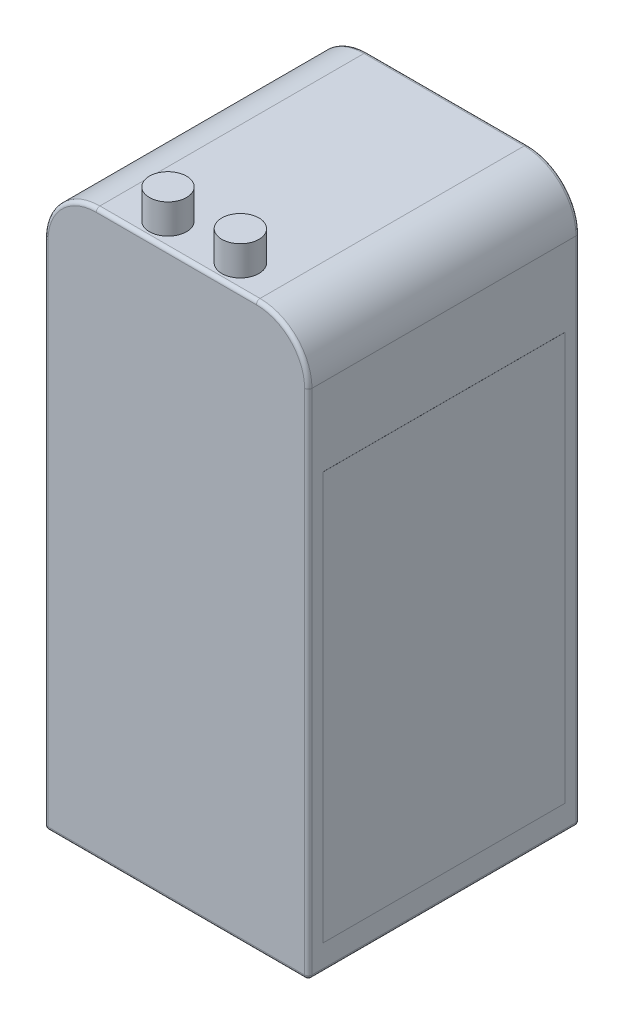
ISO-10303-21;
HEADER;
FILE_DESCRIPTION(('STEP AP214'),'2;1');
FILE_NAME('part.step','',(''),(''),'','','');
FILE_SCHEMA(('AUTOMOTIVE_DESIGN { 1 0 10303 214 1 1 1 1 }'));
ENDSEC;
DATA;
#1=APPLICATION_CONTEXT('core data for automotive mechanical design processes');
#2=APPLICATION_PROTOCOL_DEFINITION('international standard','automotive_design',2000,#1);
#3=PRODUCT_CONTEXT('',#1,'mechanical');
#4=PRODUCT('Part','Part','',(#3));
#5=PRODUCT_RELATED_PRODUCT_CATEGORY('part','',(#4));
#6=PRODUCT_DEFINITION_FORMATION('','',#4);
#7=PRODUCT_DEFINITION_CONTEXT('part definition',#1,'design');
#8=PRODUCT_DEFINITION('design','',#6,#7);
#9=PRODUCT_DEFINITION_SHAPE('','',#8);
#10=(LENGTH_UNIT() NAMED_UNIT(*) SI_UNIT(.MILLI.,.METRE.));
#11=(NAMED_UNIT(*) PLANE_ANGLE_UNIT() SI_UNIT($,.RADIAN.));
#12=(NAMED_UNIT(*) SI_UNIT($,.STERADIAN.) SOLID_ANGLE_UNIT());
#13=UNCERTAINTY_MEASURE_WITH_UNIT(LENGTH_MEASURE(1.E-05),#10,'distance_accuracy_value','');
#14=(GEOMETRIC_REPRESENTATION_CONTEXT(3) GLOBAL_UNCERTAINTY_ASSIGNED_CONTEXT((#13)) GLOBAL_UNIT_ASSIGNED_CONTEXT((#10,
#11,#12)) REPRESENTATION_CONTEXT('',''));
#15=CARTESIAN_POINT('',(0.,0.,0.));
#16=DIRECTION('',(0.,0.,1.));
#17=DIRECTION('',(1.,0.,0.));
#18=AXIS2_PLACEMENT_3D('',#15,#16,#17);
#19=CARTESIAN_POINT('',(23.120727578248,80.,-3.32332969493352));
#20=DIRECTION('',(0.,-1.,0.));
#21=DIRECTION('',(0.,0.,-1.));
#22=AXIS2_PLACEMENT_3D('',#19,#20,#21);
#23=CYLINDRICAL_SURFACE('',#22,2.5);
#24=CARTESIAN_POINT('',(23.120727578248,80.,-3.32332969493352));
#25=DIRECTION('',(0.,1.,0.));
#26=DIRECTION('',(0.,0.,1.));
#27=AXIS2_PLACEMENT_3D('',#24,#25,#26);
#28=CIRCLE('',#27,2.5);
#29=CARTESIAN_POINT('',(23.120727578248,80.,-0.823329694933518));
#30=VERTEX_POINT('',#29);
#31=EDGE_CURVE('E62',#30,#30,#28,.T.);
#32=ORIENTED_EDGE('',*,*,#31,.F.);
#33=EDGE_LOOP('',(#32));
#34=FACE_BOUND('',#33,.T.);
#35=CARTESIAN_POINT('',(23.120727578248,76.,-3.32332969493352));
#36=DIRECTION('',(0.,1.,0.));
#37=DIRECTION('',(0.,0.,1.));
#38=AXIS2_PLACEMENT_3D('',#35,#36,#37);
#39=CIRCLE('',#38,2.5);
#40=CARTESIAN_POINT('',(23.120727578248,76.,-0.823329694933518));
#41=VERTEX_POINT('',#40);
#42=EDGE_CURVE('E11',#41,#41,#39,.T.);
#43=ORIENTED_EDGE('',*,*,#42,.T.);
#44=EDGE_LOOP('',(#43));
#45=FACE_BOUND('',#44,.T.);
#46=ADVANCED_FACE('F58',(#34,#45),#23,.T.);
#47=CARTESIAN_POINT('',(23.120727578248,80.,-3.32332969493352));
#48=DIRECTION('',(0.,1.,0.));
#49=DIRECTION('',(0.,0.,1.));
#50=AXIS2_PLACEMENT_3D('',#47,#48,#49);
#51=PLANE('',#50);
#52=ORIENTED_EDGE('',*,*,#31,.T.);
#53=EDGE_LOOP('',(#52));
#54=FACE_BOUND('',#53,.T.);
#55=ADVANCED_FACE('F60',(#54),#51,.T.);
#56=CARTESIAN_POINT('',(23.120727578248,76.,-3.32332969493352));
#57=DIRECTION('',(0.,1.,0.));
#58=DIRECTION('',(0.,0.,1.));
#59=AXIS2_PLACEMENT_3D('',#56,#57,#58);
#60=PLANE('',#59);
#61=ORIENTED_EDGE('',*,*,#42,.F.);
#62=EDGE_LOOP('',(#61));
#63=FACE_BOUND('',#62,.T.);
#64=ADVANCED_FACE('F78',(#63),#60,.F.);
#65=CLOSED_SHELL('',(#46,#55,#64));
#66=MANIFOLD_SOLID_BREP('B2',#65);
#67=CARTESIAN_POINT('',(13.3548351877928,80.,-3.32332969493352));
#68=DIRECTION('',(0.,-1.,0.));
#69=DIRECTION('',(0.,0.,-1.));
#70=AXIS2_PLACEMENT_3D('',#67,#68,#69);
#71=CYLINDRICAL_SURFACE('',#70,2.5);
#72=CARTESIAN_POINT('',(13.3548351877928,80.,-3.32332969493352));
#73=DIRECTION('',(0.,1.,0.));
#74=DIRECTION('',(0.,0.,1.));
#75=AXIS2_PLACEMENT_3D('',#72,#73,#74);
#76=CIRCLE('',#75,2.5);
#77=CARTESIAN_POINT('',(13.3548351877928,80.,-0.823329694933515));
#78=VERTEX_POINT('',#77);
#79=EDGE_CURVE('E57',#78,#78,#76,.T.);
#80=ORIENTED_EDGE('',*,*,#79,.F.);
#81=EDGE_LOOP('',(#80));
#82=FACE_BOUND('',#81,.T.);
#83=CARTESIAN_POINT('',(13.3548351877928,76.,-3.32332969493352));
#84=DIRECTION('',(0.,1.,0.));
#85=DIRECTION('',(0.,0.,1.));
#86=AXIS2_PLACEMENT_3D('',#83,#84,#85);
#87=CIRCLE('',#86,2.5);
#88=CARTESIAN_POINT('',(13.3548351877928,76.,-0.823329694933515));
#89=VERTEX_POINT('',#88);
#90=EDGE_CURVE('E135',#89,#89,#87,.T.);
#91=ORIENTED_EDGE('',*,*,#90,.T.);
#92=EDGE_LOOP('',(#91));
#93=FACE_BOUND('',#92,.T.);
#94=ADVANCED_FACE('F132',(#82,#93),#71,.T.);
#95=CARTESIAN_POINT('',(13.3548351877928,80.,-3.32332969493352));
#96=DIRECTION('',(0.,1.,0.));
#97=DIRECTION('',(0.,0.,1.));
#98=AXIS2_PLACEMENT_3D('',#95,#96,#97);
#99=PLANE('',#98);
#100=ORIENTED_EDGE('',*,*,#79,.T.);
#101=EDGE_LOOP('',(#100));
#102=FACE_BOUND('',#101,.T.);
#103=ADVANCED_FACE('F147',(#102),#99,.T.);
#104=CARTESIAN_POINT('',(13.3548351877928,76.,-3.32332969493352));
#105=DIRECTION('',(0.,1.,0.));
#106=DIRECTION('',(0.,0.,1.));
#107=AXIS2_PLACEMENT_3D('',#104,#105,#106);
#108=PLANE('',#107);
#109=ORIENTED_EDGE('',*,*,#90,.F.);
#110=EDGE_LOOP('',(#109));
#111=FACE_BOUND('',#110,.T.);
#112=ADVANCED_FACE('F145',(#111),#108,.F.);
#113=CLOSED_SHELL('',(#94,#103,#112));
#114=MANIFOLD_SOLID_BREP('B6',#113);
#115=CARTESIAN_POINT('',(35.6,76.,0.));
#116=DIRECTION('',(-1.,0.,0.));
#117=DIRECTION('',(0.,0.,1.));
#118=AXIS2_PLACEMENT_3D('',#115,#116,#117);
#119=PLANE('',#118);
#120=DIRECTION('',(0.,0.,-1.));
#121=VECTOR('',#120,1.);
#122=CARTESIAN_POINT('',(35.6,69.,0.));
#123=LINE('',#122,#121);
#124=CARTESIAN_POINT('',(35.6,69.,-36.1));
#125=VERTEX_POINT('',#124);
#126=CARTESIAN_POINT('',(35.6,69.,-0.5));
#127=VERTEX_POINT('',#126);
#128=EDGE_CURVE('E362',#125,#127,#123,.F.);
#129=ORIENTED_EDGE('',*,*,#128,.T.);
#130=DIRECTION('',(0.,-1.,0.));
#131=VECTOR('',#130,1.);
#132=CARTESIAN_POINT('',(35.6,76.,-0.5));
#133=LINE('',#132,#131);
#134=CARTESIAN_POINT('',(35.6,0.5,-0.5));
#135=VERTEX_POINT('',#134);
#136=EDGE_CURVE('E387',#127,#135,#133,.T.);
#137=ORIENTED_EDGE('',*,*,#136,.T.);
#138=DIRECTION('',(0.,0.,-1.));
#139=VECTOR('',#138,1.);
#140=CARTESIAN_POINT('',(35.6,0.5,-36.6));
#141=LINE('',#140,#139);
#142=CARTESIAN_POINT('',(35.6,0.5,-36.1));
#143=VERTEX_POINT('',#142);
#144=EDGE_CURVE('E383',#135,#143,#141,.T.);
#145=ORIENTED_EDGE('',*,*,#144,.T.);
#146=DIRECTION('',(0.,-1.,0.));
#147=VECTOR('',#146,1.);
#148=CARTESIAN_POINT('',(35.6,76.,-36.1));
#149=LINE('',#148,#147);
#150=EDGE_CURVE('E385',#143,#125,#149,.F.);
#151=ORIENTED_EDGE('',*,*,#150,.T.);
#152=EDGE_LOOP('',(#129,#137,#145,#151));
#153=FACE_BOUND('',#152,.T.);
#154=DIRECTION('',(0.,-1.,0.));
#155=VECTOR('',#154,1.);
#156=CARTESIAN_POINT('',(35.6,58.5,-2.));
#157=LINE('',#156,#155);
#158=CARTESIAN_POINT('',(35.6,58.5,-2.));
#159=VERTEX_POINT('',#158);
#160=CARTESIAN_POINT('',(35.6,3.5,-2.00000000000001));
#161=VERTEX_POINT('',#160);
#162=EDGE_CURVE('E344',#159,#161,#157,.T.);
#163=ORIENTED_EDGE('',*,*,#162,.F.);
#164=DIRECTION('',(0.,0.,1.));
#165=VECTOR('',#164,1.);
#166=CARTESIAN_POINT('',(35.6,58.5,-2.));
#167=LINE('',#166,#165);
#168=CARTESIAN_POINT('',(35.6,58.5,-34.6));
#169=VERTEX_POINT('',#168);
#170=EDGE_CURVE('E341',#169,#159,#167,.T.);
#171=ORIENTED_EDGE('',*,*,#170,.F.);
#172=DIRECTION('',(0.,1.,0.));
#173=VECTOR('',#172,1.);
#174=CARTESIAN_POINT('',(35.6,58.5,-34.6));
#175=LINE('',#174,#173);
#176=CARTESIAN_POINT('',(35.6,3.5,-34.6));
#177=VERTEX_POINT('',#176);
#178=EDGE_CURVE('E219',#177,#169,#175,.T.);
#179=ORIENTED_EDGE('',*,*,#178,.F.);
#180=DIRECTION('',(0.,0.,-1.));
#181=VECTOR('',#180,1.);
#182=CARTESIAN_POINT('',(35.6,3.5,-2.00000000000001));
#183=LINE('',#182,#181);
#184=EDGE_CURVE('E214',#161,#177,#183,.T.);
#185=ORIENTED_EDGE('',*,*,#184,.F.);
#186=EDGE_LOOP('',(#163,#171,#179,#185));
#187=FACE_BOUND('',#186,.T.);
#188=ADVANCED_FACE('F197',(#153,#187),#119,.F.);
#189=CARTESIAN_POINT('',(0.,76.,0.));
#190=DIRECTION('',(1.,0.,0.));
#191=DIRECTION('',(0.,0.,-1.));
#192=AXIS2_PLACEMENT_3D('',#189,#190,#191);
#193=PLANE('',#192);
#194=DIRECTION('',(0.,0.,1.));
#195=VECTOR('',#194,1.);
#196=CARTESIAN_POINT('',(0.,0.5,0.));
#197=LINE('',#196,#195);
#198=CARTESIAN_POINT('',(0.,0.5,-36.1));
#199=VERTEX_POINT('',#198);
#200=CARTESIAN_POINT('',(0.,0.5,-0.5));
#201=VERTEX_POINT('',#200);
#202=EDGE_CURVE('E398',#199,#201,#197,.T.);
#203=ORIENTED_EDGE('',*,*,#202,.T.);
#204=DIRECTION('',(0.,-1.,0.));
#205=VECTOR('',#204,1.);
#206=CARTESIAN_POINT('',(0.,76.,-0.5));
#207=LINE('',#206,#205);
#208=CARTESIAN_POINT('',(0.,69.,-0.5));
#209=VERTEX_POINT('',#208);
#210=EDGE_CURVE('E402',#201,#209,#207,.F.);
#211=ORIENTED_EDGE('',*,*,#210,.T.);
#212=DIRECTION('',(0.,0.,1.));
#213=VECTOR('',#212,1.);
#214=CARTESIAN_POINT('',(0.,69.,0.));
#215=LINE('',#214,#213);
#216=CARTESIAN_POINT('',(0.,69.,-36.1));
#217=VERTEX_POINT('',#216);
#218=EDGE_CURVE('E359',#209,#217,#215,.F.);
#219=ORIENTED_EDGE('',*,*,#218,.T.);
#220=DIRECTION('',(0.,-1.,0.));
#221=VECTOR('',#220,1.);
#222=CARTESIAN_POINT('',(0.,76.,-36.1));
#223=LINE('',#222,#221);
#224=EDGE_CURVE('E400',#217,#199,#223,.T.);
#225=ORIENTED_EDGE('',*,*,#224,.T.);
#226=EDGE_LOOP('',(#203,#211,#219,#225));
#227=FACE_BOUND('',#226,.T.);
#228=ADVANCED_FACE('F489',(#227),#193,.F.);
#229=CARTESIAN_POINT('',(0.,76.,0.));
#230=DIRECTION('',(0.,0.,-1.));
#231=DIRECTION('',(-1.,0.,0.));
#232=AXIS2_PLACEMENT_3D('',#229,#230,#231);
#233=PLANE('',#232);
#234=DIRECTION('',(0.,-1.,0.));
#235=VECTOR('',#234,1.);
#236=CARTESIAN_POINT('',(35.1,76.,0.));
#237=LINE('',#236,#235);
#238=CARTESIAN_POINT('',(35.1,0.5,0.));
#239=VERTEX_POINT('',#238);
#240=CARTESIAN_POINT('',(35.1,69.,0.));
#241=VERTEX_POINT('',#240);
#242=EDGE_CURVE('E373',#239,#241,#237,.F.);
#243=ORIENTED_EDGE('',*,*,#242,.T.);
#244=CARTESIAN_POINT('',(28.6,69.,0.));
#245=DIRECTION('',(0.,0.,-1.));
#246=DIRECTION('',(-1.,0.,0.));
#247=AXIS2_PLACEMENT_3D('',#244,#245,#246);
#248=CIRCLE('',#247,6.5);
#249=CARTESIAN_POINT('',(28.6,75.5,0.));
#250=VERTEX_POINT('',#249);
#251=EDGE_CURVE('E375',#241,#250,#248,.F.);
#252=ORIENTED_EDGE('',*,*,#251,.T.);
#253=DIRECTION('',(1.,0.,0.));
#254=VECTOR('',#253,1.);
#255=CARTESIAN_POINT('',(0.,75.5,0.));
#256=LINE('',#255,#254);
#257=CARTESIAN_POINT('',(7.,75.5,0.));
#258=VERTEX_POINT('',#257);
#259=EDGE_CURVE('E365',#250,#258,#256,.F.);
#260=ORIENTED_EDGE('',*,*,#259,.T.);
#261=CARTESIAN_POINT('',(7.,69.,0.));
#262=DIRECTION('',(0.,0.,-1.));
#263=DIRECTION('',(-1.,0.,0.));
#264=AXIS2_PLACEMENT_3D('',#261,#262,#263);
#265=CIRCLE('',#264,6.5);
#266=CARTESIAN_POINT('',(0.5,69.,0.));
#267=VERTEX_POINT('',#266);
#268=EDGE_CURVE('E367',#258,#267,#265,.F.);
#269=ORIENTED_EDGE('',*,*,#268,.T.);
#270=DIRECTION('',(0.,-1.,0.));
#271=VECTOR('',#270,1.);
#272=CARTESIAN_POINT('',(0.5,76.,0.));
#273=LINE('',#272,#271);
#274=CARTESIAN_POINT('',(0.5,0.5,0.));
#275=VERTEX_POINT('',#274);
#276=EDGE_CURVE('E369',#267,#275,#273,.T.);
#277=ORIENTED_EDGE('',*,*,#276,.T.);
#278=DIRECTION('',(1.,0.,0.));
#279=VECTOR('',#278,1.);
#280=CARTESIAN_POINT('',(35.6,0.5,0.));
#281=LINE('',#280,#279);
#282=EDGE_CURVE('E371',#275,#239,#281,.T.);
#283=ORIENTED_EDGE('',*,*,#282,.T.);
#284=EDGE_LOOP('',(#243,#252,#260,#269,#277,#283));
#285=FACE_BOUND('',#284,.T.);
#286=ADVANCED_FACE('F523',(#285),#233,.F.);
#287=CARTESIAN_POINT('',(0.,76.,-36.6));
#288=DIRECTION('',(0.,0.,1.));
#289=DIRECTION('',(1.,0.,0.));
#290=AXIS2_PLACEMENT_3D('',#287,#288,#289);
#291=PLANE('',#290);
#292=DIRECTION('',(0.,-1.,0.));
#293=VECTOR('',#292,1.);
#294=CARTESIAN_POINT('',(35.1,76.,-36.6));
#295=LINE('',#294,#293);
#296=CARTESIAN_POINT('',(35.1,69.,-36.6));
#297=VERTEX_POINT('',#296);
#298=CARTESIAN_POINT('',(35.1,0.5,-36.6));
#299=VERTEX_POINT('',#298);
#300=EDGE_CURVE('E206',#297,#299,#295,.T.);
#301=ORIENTED_EDGE('',*,*,#300,.T.);
#302=DIRECTION('',(-1.,0.,0.));
#303=VECTOR('',#302,1.);
#304=CARTESIAN_POINT('',(0.,0.5,-36.6));
#305=LINE('',#304,#303);
#306=CARTESIAN_POINT('',(0.5,0.5,-36.6));
#307=VERTEX_POINT('',#306);
#308=EDGE_CURVE('E130',#299,#307,#305,.T.);
#309=ORIENTED_EDGE('',*,*,#308,.T.);
#310=DIRECTION('',(0.,-1.,0.));
#311=VECTOR('',#310,1.);
#312=CARTESIAN_POINT('',(0.5,76.,-36.6));
#313=LINE('',#312,#311);
#314=CARTESIAN_POINT('',(0.5,69.,-36.6));
#315=VERTEX_POINT('',#314);
#316=EDGE_CURVE('E412',#307,#315,#313,.F.);
#317=ORIENTED_EDGE('',*,*,#316,.T.);
#318=CARTESIAN_POINT('',(7.,69.,-36.6));
#319=DIRECTION('',(0.,0.,1.));
#320=DIRECTION('',(1.,0.,0.));
#321=AXIS2_PLACEMENT_3D('',#318,#319,#320);
#322=CIRCLE('',#321,6.5);
#323=CARTESIAN_POINT('',(7.,75.5,-36.6));
#324=VERTEX_POINT('',#323);
#325=EDGE_CURVE('E414',#315,#324,#322,.F.);
#326=ORIENTED_EDGE('',*,*,#325,.T.);
#327=DIRECTION('',(-1.,0.,0.));
#328=VECTOR('',#327,1.);
#329=CARTESIAN_POINT('',(0.,75.5,-36.6));
#330=LINE('',#329,#328);
#331=CARTESIAN_POINT('',(28.6,75.5,-36.6));
#332=VERTEX_POINT('',#331);
#333=EDGE_CURVE('E416',#324,#332,#330,.F.);
#334=ORIENTED_EDGE('',*,*,#333,.T.);
#335=CARTESIAN_POINT('',(28.6,69.,-36.6));
#336=DIRECTION('',(0.,0.,1.));
#337=DIRECTION('',(1.,0.,0.));
#338=AXIS2_PLACEMENT_3D('',#335,#336,#337);
#339=CIRCLE('',#338,6.5);
#340=EDGE_CURVE('E418',#332,#297,#339,.F.);
#341=ORIENTED_EDGE('',*,*,#340,.T.);
#342=EDGE_LOOP('',(#301,#309,#317,#326,#334,#341));
#343=FACE_BOUND('',#342,.T.);
#344=ADVANCED_FACE('F562',(#343),#291,.F.);
#345=CARTESIAN_POINT('',(0.,76.,0.));
#346=DIRECTION('',(0.,-1.,0.));
#347=DIRECTION('',(0.,0.,-1.));
#348=AXIS2_PLACEMENT_3D('',#345,#346,#347);
#349=PLANE('',#348);
#350=DIRECTION('',(0.,0.,1.));
#351=VECTOR('',#350,1.);
#352=CARTESIAN_POINT('',(7.,76.,0.));
#353=LINE('',#352,#351);
#354=CARTESIAN_POINT('',(7.,76.,-36.1));
#355=VERTEX_POINT('',#354);
#356=CARTESIAN_POINT('',(7.,76.,-0.5));
#357=VERTEX_POINT('',#356);
#358=EDGE_CURVE('E356',#355,#357,#353,.T.);
#359=ORIENTED_EDGE('',*,*,#358,.T.);
#360=DIRECTION('',(1.,0.,0.));
#361=VECTOR('',#360,1.);
#362=CARTESIAN_POINT('',(0.,76.,-0.5));
#363=LINE('',#362,#361);
#364=CARTESIAN_POINT('',(28.6,76.,-0.5));
#365=VERTEX_POINT('',#364);
#366=EDGE_CURVE('E410',#357,#365,#363,.T.);
#367=ORIENTED_EDGE('',*,*,#366,.T.);
#368=DIRECTION('',(0.,0.,-1.));
#369=VECTOR('',#368,1.);
#370=CARTESIAN_POINT('',(28.6,76.,0.));
#371=LINE('',#370,#369);
#372=CARTESIAN_POINT('',(28.6,76.,-36.1));
#373=VERTEX_POINT('',#372);
#374=EDGE_CURVE('E353',#365,#373,#371,.T.);
#375=ORIENTED_EDGE('',*,*,#374,.T.);
#376=DIRECTION('',(-1.,0.,0.));
#377=VECTOR('',#376,1.);
#378=CARTESIAN_POINT('',(0.,76.,-36.1));
#379=LINE('',#378,#377);
#380=EDGE_CURVE('E408',#373,#355,#379,.T.);
#381=ORIENTED_EDGE('',*,*,#380,.T.);
#382=EDGE_LOOP('',(#359,#367,#375,#381));
#383=FACE_BOUND('',#382,.T.);
#384=ADVANCED_FACE('F506',(#383),#349,.F.);
#385=CARTESIAN_POINT('',(0.,0.,0.));
#386=DIRECTION('',(0.,-1.,0.));
#387=DIRECTION('',(0.,0.,-1.));
#388=AXIS2_PLACEMENT_3D('',#385,#386,#387);
#389=PLANE('',#388);
#390=DIRECTION('',(1.,0.,0.));
#391=VECTOR('',#390,1.);
#392=CARTESIAN_POINT('',(0.,0.,-0.5));
#393=LINE('',#392,#391);
#394=CARTESIAN_POINT('',(35.1,0.,-0.5));
#395=VERTEX_POINT('',#394);
#396=CARTESIAN_POINT('',(0.5,0.,-0.5));
#397=VERTEX_POINT('',#396);
#398=EDGE_CURVE('E393',#395,#397,#393,.F.);
#399=ORIENTED_EDGE('',*,*,#398,.T.);
#400=DIRECTION('',(0.,0.,1.));
#401=VECTOR('',#400,1.);
#402=CARTESIAN_POINT('',(0.5,0.,-36.6));
#403=LINE('',#402,#401);
#404=CARTESIAN_POINT('',(0.5,0.,-36.1));
#405=VERTEX_POINT('',#404);
#406=EDGE_CURVE('E396',#397,#405,#403,.F.);
#407=ORIENTED_EDGE('',*,*,#406,.T.);
#408=DIRECTION('',(-1.,0.,0.));
#409=VECTOR('',#408,1.);
#410=CARTESIAN_POINT('',(35.6,0.,-36.1));
#411=LINE('',#410,#409);
#412=CARTESIAN_POINT('',(35.1,0.,-36.1));
#413=VERTEX_POINT('',#412);
#414=EDGE_CURVE('E391',#405,#413,#411,.F.);
#415=ORIENTED_EDGE('',*,*,#414,.T.);
#416=DIRECTION('',(0.,0.,-1.));
#417=VECTOR('',#416,1.);
#418=CARTESIAN_POINT('',(35.1,0.,0.));
#419=LINE('',#418,#417);
#420=EDGE_CURVE('E389',#413,#395,#419,.F.);
#421=ORIENTED_EDGE('',*,*,#420,.T.);
#422=EDGE_LOOP('',(#399,#407,#415,#421));
#423=FACE_BOUND('',#422,.T.);
#424=ADVANCED_FACE('F544',(#423),#389,.T.);
#425=CARTESIAN_POINT('',(7.,69.,0.));
#426=DIRECTION('',(0.,0.,1.));
#427=DIRECTION('',(1.,0.,0.));
#428=AXIS2_PLACEMENT_3D('',#425,#426,#427);
#429=CYLINDRICAL_SURFACE('',#428,7.);
#430=ORIENTED_EDGE('',*,*,#218,.F.);
#431=CARTESIAN_POINT('',(7.,69.,-0.5));
#432=DIRECTION('',(0.,0.,-1.));
#433=DIRECTION('',(-1.,0.,0.));
#434=AXIS2_PLACEMENT_3D('',#431,#432,#433);
#435=CIRCLE('',#434,7.);
#436=EDGE_CURVE('E406',#209,#357,#435,.T.);
#437=ORIENTED_EDGE('',*,*,#436,.T.);
#438=ORIENTED_EDGE('',*,*,#358,.F.);
#439=CARTESIAN_POINT('',(7.,69.,-36.1));
#440=DIRECTION('',(0.,0.,1.));
#441=DIRECTION('',(1.,0.,0.));
#442=AXIS2_PLACEMENT_3D('',#439,#440,#441);
#443=CIRCLE('',#442,7.);
#444=EDGE_CURVE('E404',#355,#217,#443,.T.);
#445=ORIENTED_EDGE('',*,*,#444,.T.);
#446=EDGE_LOOP('',(#430,#437,#438,#445));
#447=FACE_BOUND('',#446,.T.);
#448=ADVANCED_FACE('F486',(#447),#429,.T.);
#449=CARTESIAN_POINT('',(28.6,69.,0.));
#450=DIRECTION('',(0.,0.,-1.));
#451=DIRECTION('',(-1.,0.,0.));
#452=AXIS2_PLACEMENT_3D('',#449,#450,#451);
#453=CYLINDRICAL_SURFACE('',#452,7.);
#454=ORIENTED_EDGE('',*,*,#374,.F.);
#455=CARTESIAN_POINT('',(28.6,69.,-0.5));
#456=DIRECTION('',(0.,0.,-1.));
#457=DIRECTION('',(-1.,0.,0.));
#458=AXIS2_PLACEMENT_3D('',#455,#456,#457);
#459=CIRCLE('',#458,7.);
#460=EDGE_CURVE('E380',#365,#127,#459,.T.);
#461=ORIENTED_EDGE('',*,*,#460,.T.);
#462=ORIENTED_EDGE('',*,*,#128,.F.);
#463=CARTESIAN_POINT('',(28.6,69.,-36.1));
#464=DIRECTION('',(0.,0.,1.));
#465=DIRECTION('',(1.,0.,0.));
#466=AXIS2_PLACEMENT_3D('',#463,#464,#465);
#467=CIRCLE('',#466,7.);
#468=EDGE_CURVE('E378',#125,#373,#467,.T.);
#469=ORIENTED_EDGE('',*,*,#468,.T.);
#470=EDGE_LOOP('',(#454,#461,#462,#469));
#471=FACE_BOUND('',#470,.T.);
#472=ADVANCED_FACE('F510',(#471),#453,.T.);
#473=CARTESIAN_POINT('',(7.,69.,-36.1));
#474=DIRECTION('',(0.,0.,1.));
#475=DIRECTION('',(1.,0.,0.));
#476=AXIS2_PLACEMENT_3D('',#473,#474,#475);
#477=TOROIDAL_SURFACE('',#476,6.5,0.5);
#478=CARTESIAN_POINT('',(0.5,69.,-36.1));
#479=DIRECTION('',(0.,-1.,0.));
#480=DIRECTION('',(0.,0.,-1.));
#481=AXIS2_PLACEMENT_3D('',#478,#479,#480);
#482=CIRCLE('',#481,0.5);
#483=EDGE_CURVE('E467',#217,#315,#482,.T.);
#484=ORIENTED_EDGE('',*,*,#483,.F.);
#485=ORIENTED_EDGE('',*,*,#444,.F.);
#486=CARTESIAN_POINT('',(7.,75.5,-36.1));
#487=DIRECTION('',(1.,0.,0.));
#488=DIRECTION('',(0.,0.,-1.));
#489=AXIS2_PLACEMENT_3D('',#486,#487,#488);
#490=CIRCLE('',#489,0.5);
#491=EDGE_CURVE('E201',#324,#355,#490,.T.);
#492=ORIENTED_EDGE('',*,*,#491,.F.);
#493=ORIENTED_EDGE('',*,*,#325,.F.);
#494=EDGE_LOOP('',(#484,#485,#492,#493));
#495=FACE_BOUND('',#494,.T.);
#496=ADVANCED_FACE('F199',(#495),#477,.T.);
#497=CARTESIAN_POINT('',(0.,75.5,-36.1));
#498=DIRECTION('',(-1.,0.,0.));
#499=DIRECTION('',(0.,0.,1.));
#500=AXIS2_PLACEMENT_3D('',#497,#498,#499);
#501=CYLINDRICAL_SURFACE('',#500,0.5);
#502=ORIENTED_EDGE('',*,*,#491,.T.);
#503=ORIENTED_EDGE('',*,*,#380,.F.);
#504=CARTESIAN_POINT('',(28.6,75.5,-36.1));
#505=DIRECTION('',(1.,0.,0.));
#506=DIRECTION('',(0.,0.,-1.));
#507=AXIS2_PLACEMENT_3D('',#504,#505,#506);
#508=CIRCLE('',#507,0.5);
#509=EDGE_CURVE('E465',#332,#373,#508,.T.);
#510=ORIENTED_EDGE('',*,*,#509,.F.);
#511=ORIENTED_EDGE('',*,*,#333,.F.);
#512=EDGE_LOOP('',(#502,#503,#510,#511));
#513=FACE_BOUND('',#512,.T.);
#514=ADVANCED_FACE('F478',(#513),#501,.T.);
#515=CARTESIAN_POINT('',(0.5,76.,-36.1));
#516=DIRECTION('',(0.,-1.,0.));
#517=DIRECTION('',(0.,0.,-1.));
#518=AXIS2_PLACEMENT_3D('',#515,#516,#517);
#519=CYLINDRICAL_SURFACE('',#518,0.5);
#520=ORIENTED_EDGE('',*,*,#483,.T.);
#521=ORIENTED_EDGE('',*,*,#316,.F.);
#522=CARTESIAN_POINT('',(0.5,0.5,-36.1));
#523=DIRECTION('',(0.,-1.,0.));
#524=DIRECTION('',(0.,0.,-1.));
#525=AXIS2_PLACEMENT_3D('',#522,#523,#524);
#526=CIRCLE('',#525,0.5);
#527=EDGE_CURVE('E462',#199,#307,#526,.T.);
#528=ORIENTED_EDGE('',*,*,#527,.F.);
#529=ORIENTED_EDGE('',*,*,#224,.F.);
#530=EDGE_LOOP('',(#520,#521,#528,#529));
#531=FACE_BOUND('',#530,.T.);
#532=ADVANCED_FACE('F563',(#531),#519,.T.);
#533=CARTESIAN_POINT('',(28.6,69.,-36.1));
#534=DIRECTION('',(0.,0.,1.));
#535=DIRECTION('',(1.,0.,0.));
#536=AXIS2_PLACEMENT_3D('',#533,#534,#535);
#537=TOROIDAL_SURFACE('',#536,6.5,0.5);
#538=ORIENTED_EDGE('',*,*,#509,.T.);
#539=ORIENTED_EDGE('',*,*,#468,.F.);
#540=CARTESIAN_POINT('',(35.1,69.,-36.1));
#541=DIRECTION('',(0.,-1.,0.));
#542=DIRECTION('',(0.,0.,-1.));
#543=AXIS2_PLACEMENT_3D('',#540,#541,#542);
#544=CIRCLE('',#543,0.5);
#545=EDGE_CURVE('E459',#297,#125,#544,.T.);
#546=ORIENTED_EDGE('',*,*,#545,.F.);
#547=ORIENTED_EDGE('',*,*,#340,.F.);
#548=EDGE_LOOP('',(#538,#539,#546,#547));
#549=FACE_BOUND('',#548,.T.);
#550=ADVANCED_FACE('F559',(#549),#537,.T.);
#551=CARTESIAN_POINT('',(0.5,0.5,-36.1));
#552=DIRECTION('',(0.,0.,-1.));
#553=DIRECTION('',(0.,1.,0.));
#554=AXIS2_PLACEMENT_3D('',#551,#552,#553);
#555=SPHERICAL_SURFACE('',#554,0.5);
#556=CARTESIAN_POINT('',(0.5,0.5,-36.1));
#557=DIRECTION('',(0.,0.,-1.));
#558=DIRECTION('',(-1.,0.,0.));
#559=AXIS2_PLACEMENT_3D('',#556,#557,#558);
#560=CIRCLE('',#559,0.5);
#561=EDGE_CURVE('E454',#199,#405,#560,.F.);
#562=ORIENTED_EDGE('',*,*,#561,.F.);
#563=ORIENTED_EDGE('',*,*,#527,.T.);
#564=CARTESIAN_POINT('',(0.5,0.5,-36.1));
#565=DIRECTION('',(-1.,0.,0.));
#566=DIRECTION('',(0.,0.,1.));
#567=AXIS2_PLACEMENT_3D('',#564,#565,#566);
#568=CIRCLE('',#567,0.5);
#569=EDGE_CURVE('E457',#405,#307,#568,.F.);
#570=ORIENTED_EDGE('',*,*,#569,.F.);
#571=EDGE_LOOP('',(#562,#563,#570));
#572=FACE_BOUND('',#571,.T.);
#573=ADVANCED_FACE('F567',(#572),#555,.T.);
#574=CARTESIAN_POINT('',(35.1,76.,-36.1));
#575=DIRECTION('',(0.,-1.,0.));
#576=DIRECTION('',(0.,0.,-1.));
#577=AXIS2_PLACEMENT_3D('',#574,#575,#576);
#578=CYLINDRICAL_SURFACE('',#577,0.5);
#579=ORIENTED_EDGE('',*,*,#545,.T.);
#580=ORIENTED_EDGE('',*,*,#150,.F.);
#581=CARTESIAN_POINT('',(35.1,0.5,-36.1));
#582=DIRECTION('',(0.,-1.,0.));
#583=DIRECTION('',(0.,0.,-1.));
#584=AXIS2_PLACEMENT_3D('',#581,#582,#583);
#585=CIRCLE('',#584,0.5);
#586=EDGE_CURVE('E451',#299,#143,#585,.T.);
#587=ORIENTED_EDGE('',*,*,#586,.F.);
#588=ORIENTED_EDGE('',*,*,#300,.F.);
#589=EDGE_LOOP('',(#579,#580,#587,#588));
#590=FACE_BOUND('',#589,.T.);
#591=ADVANCED_FACE('F556',(#590),#578,.T.);
#592=CARTESIAN_POINT('',(0.,0.5,-36.1));
#593=DIRECTION('',(1.,0.,0.));
#594=DIRECTION('',(0.,0.,-1.));
#595=AXIS2_PLACEMENT_3D('',#592,#593,#594);
#596=CYLINDRICAL_SURFACE('',#595,0.5);
#597=ORIENTED_EDGE('',*,*,#569,.T.);
#598=ORIENTED_EDGE('',*,*,#308,.F.);
#599=CARTESIAN_POINT('',(35.1,0.5,-36.1));
#600=DIRECTION('',(1.,0.,0.));
#601=DIRECTION('',(0.,0.,-1.));
#602=AXIS2_PLACEMENT_3D('',#599,#600,#601);
#603=CIRCLE('',#602,0.5);
#604=EDGE_CURVE('E448',#413,#299,#603,.T.);
#605=ORIENTED_EDGE('',*,*,#604,.F.);
#606=ORIENTED_EDGE('',*,*,#414,.F.);
#607=EDGE_LOOP('',(#597,#598,#605,#606));
#608=FACE_BOUND('',#607,.T.);
#609=ADVANCED_FACE('F550',(#608),#596,.T.);
#610=CARTESIAN_POINT('',(0.5,0.5,0.));
#611=DIRECTION('',(0.,0.,-1.));
#612=DIRECTION('',(-1.,0.,0.));
#613=AXIS2_PLACEMENT_3D('',#610,#611,#612);
#614=CYLINDRICAL_SURFACE('',#613,0.5);
#615=ORIENTED_EDGE('',*,*,#561,.T.);
#616=ORIENTED_EDGE('',*,*,#406,.F.);
#617=CARTESIAN_POINT('',(0.5,0.5,-0.5));
#618=DIRECTION('',(0.,0.,1.));
#619=DIRECTION('',(1.,0.,0.));
#620=AXIS2_PLACEMENT_3D('',#617,#618,#619);
#621=CIRCLE('',#620,0.5);
#622=EDGE_CURVE('E445',#201,#397,#621,.T.);
#623=ORIENTED_EDGE('',*,*,#622,.F.);
#624=ORIENTED_EDGE('',*,*,#202,.F.);
#625=EDGE_LOOP('',(#615,#616,#623,#624));
#626=FACE_BOUND('',#625,.T.);
#627=ADVANCED_FACE('F569',(#626),#614,.T.);
#628=CARTESIAN_POINT('',(35.1,0.5,-36.1));
#629=DIRECTION('',(0.,0.,-1.));
#630=DIRECTION('',(0.,1.,0.));
#631=AXIS2_PLACEMENT_3D('',#628,#629,#630);
#632=SPHERICAL_SURFACE('',#631,0.5);
#633=ORIENTED_EDGE('',*,*,#604,.T.);
#634=ORIENTED_EDGE('',*,*,#586,.T.);
#635=CARTESIAN_POINT('',(35.1,0.5,-36.1));
#636=DIRECTION('',(0.,0.,-1.));
#637=DIRECTION('',(-1.,0.,0.));
#638=AXIS2_PLACEMENT_3D('',#635,#636,#637);
#639=CIRCLE('',#638,0.5);
#640=EDGE_CURVE('E442',#413,#143,#639,.F.);
#641=ORIENTED_EDGE('',*,*,#640,.F.);
#642=EDGE_LOOP('',(#633,#634,#641));
#643=FACE_BOUND('',#642,.T.);
#644=ADVANCED_FACE('F553',(#643),#632,.T.);
#645=CARTESIAN_POINT('',(0.5,0.5,-0.5));
#646=DIRECTION('',(0.,-1.,0.));
#647=DIRECTION('',(0.,0.,-1.));
#648=AXIS2_PLACEMENT_3D('',#645,#646,#647);
#649=SPHERICAL_SURFACE('',#648,0.5);
#650=CARTESIAN_POINT('',(0.5,0.5,-0.5));
#651=DIRECTION('',(0.,-1.,0.));
#652=DIRECTION('',(0.,0.,-1.));
#653=AXIS2_PLACEMENT_3D('',#650,#651,#652);
#654=CIRCLE('',#653,0.5);
#655=EDGE_CURVE('E437',#201,#275,#654,.F.);
#656=ORIENTED_EDGE('',*,*,#655,.F.);
#657=ORIENTED_EDGE('',*,*,#622,.T.);
#658=CARTESIAN_POINT('',(0.5,0.5,-0.5));
#659=DIRECTION('',(-1.,0.,0.));
#660=DIRECTION('',(0.,0.,1.));
#661=AXIS2_PLACEMENT_3D('',#658,#659,#660);
#662=CIRCLE('',#661,0.5);
#663=EDGE_CURVE('E440',#275,#397,#662,.F.);
#664=ORIENTED_EDGE('',*,*,#663,.F.);
#665=EDGE_LOOP('',(#656,#657,#664));
#666=FACE_BOUND('',#665,.T.);
#667=ADVANCED_FACE('F571',(#666),#649,.T.);
#668=CARTESIAN_POINT('',(35.1,0.5,0.));
#669=DIRECTION('',(0.,0.,1.));
#670=DIRECTION('',(1.,0.,0.));
#671=AXIS2_PLACEMENT_3D('',#668,#669,#670);
#672=CYLINDRICAL_SURFACE('',#671,0.5);
#673=ORIENTED_EDGE('',*,*,#640,.T.);
#674=ORIENTED_EDGE('',*,*,#144,.F.);
#675=CARTESIAN_POINT('',(35.1,0.5,-0.5));
#676=DIRECTION('',(0.,0.,1.));
#677=DIRECTION('',(1.,0.,0.));
#678=AXIS2_PLACEMENT_3D('',#675,#676,#677);
#679=CIRCLE('',#678,0.5);
#680=EDGE_CURVE('E434',#395,#135,#679,.T.);
#681=ORIENTED_EDGE('',*,*,#680,.F.);
#682=ORIENTED_EDGE('',*,*,#420,.F.);
#683=EDGE_LOOP('',(#673,#674,#681,#682));
#684=FACE_BOUND('',#683,.T.);
#685=ADVANCED_FACE('F535',(#684),#672,.T.);
#686=CARTESIAN_POINT('',(0.,0.5,-0.5));
#687=DIRECTION('',(-1.,0.,0.));
#688=DIRECTION('',(0.,0.,1.));
#689=AXIS2_PLACEMENT_3D('',#686,#687,#688);
#690=CYLINDRICAL_SURFACE('',#689,0.5);
#691=ORIENTED_EDGE('',*,*,#663,.T.);
#692=ORIENTED_EDGE('',*,*,#398,.F.);
#693=CARTESIAN_POINT('',(35.1,0.5,-0.5));
#694=DIRECTION('',(1.,0.,0.));
#695=DIRECTION('',(0.,0.,-1.));
#696=AXIS2_PLACEMENT_3D('',#693,#694,#695);
#697=CIRCLE('',#696,0.5);
#698=EDGE_CURVE('E431',#239,#395,#697,.T.);
#699=ORIENTED_EDGE('',*,*,#698,.F.);
#700=ORIENTED_EDGE('',*,*,#282,.F.);
#701=EDGE_LOOP('',(#691,#692,#699,#700));
#702=FACE_BOUND('',#701,.T.);
#703=ADVANCED_FACE('F542',(#702),#690,.T.);
#704=CARTESIAN_POINT('',(0.5,76.,-0.5));
#705=DIRECTION('',(0.,-1.,0.));
#706=DIRECTION('',(0.,0.,-1.));
#707=AXIS2_PLACEMENT_3D('',#704,#705,#706);
#708=CYLINDRICAL_SURFACE('',#707,0.5);
#709=ORIENTED_EDGE('',*,*,#655,.T.);
#710=ORIENTED_EDGE('',*,*,#276,.F.);
#711=CARTESIAN_POINT('',(0.5,69.,-0.5));
#712=DIRECTION('',(0.,1.,0.));
#713=DIRECTION('',(0.,0.,1.));
#714=AXIS2_PLACEMENT_3D('',#711,#712,#713);
#715=CIRCLE('',#714,0.5);
#716=EDGE_CURVE('E428',#209,#267,#715,.T.);
#717=ORIENTED_EDGE('',*,*,#716,.F.);
#718=ORIENTED_EDGE('',*,*,#210,.F.);
#719=EDGE_LOOP('',(#709,#710,#717,#718));
#720=FACE_BOUND('',#719,.T.);
#721=ADVANCED_FACE('F495',(#720),#708,.T.);
#722=CARTESIAN_POINT('',(35.1,0.5,-0.5));
#723=DIRECTION('',(0.,-1.,0.));
#724=DIRECTION('',(0.,0.,-1.));
#725=AXIS2_PLACEMENT_3D('',#722,#723,#724);
#726=SPHERICAL_SURFACE('',#725,0.5);
#727=ORIENTED_EDGE('',*,*,#698,.T.);
#728=ORIENTED_EDGE('',*,*,#680,.T.);
#729=CARTESIAN_POINT('',(35.1,0.5,-0.5));
#730=DIRECTION('',(0.,-1.,0.));
#731=DIRECTION('',(0.,0.,-1.));
#732=AXIS2_PLACEMENT_3D('',#729,#730,#731);
#733=CIRCLE('',#732,0.5);
#734=EDGE_CURVE('E425',#239,#135,#733,.F.);
#735=ORIENTED_EDGE('',*,*,#734,.F.);
#736=EDGE_LOOP('',(#727,#728,#735));
#737=FACE_BOUND('',#736,.T.);
#738=ADVANCED_FACE('F539',(#737),#726,.T.);
#739=CARTESIAN_POINT('',(7.,69.,-0.5));
#740=DIRECTION('',(0.,0.,-1.));
#741=DIRECTION('',(-1.,0.,0.));
#742=AXIS2_PLACEMENT_3D('',#739,#740,#741);
#743=TOROIDAL_SURFACE('',#742,6.5,0.5);
#744=ORIENTED_EDGE('',*,*,#716,.T.);
#745=ORIENTED_EDGE('',*,*,#268,.F.);
#746=CARTESIAN_POINT('',(7.,75.5,-0.5));
#747=DIRECTION('',(1.,0.,0.));
#748=DIRECTION('',(0.,0.,-1.));
#749=AXIS2_PLACEMENT_3D('',#746,#747,#748);
#750=CIRCLE('',#749,0.5);
#751=EDGE_CURVE('E422',#357,#258,#750,.T.);
#752=ORIENTED_EDGE('',*,*,#751,.F.);
#753=ORIENTED_EDGE('',*,*,#436,.F.);
#754=EDGE_LOOP('',(#744,#745,#752,#753));
#755=FACE_BOUND('',#754,.T.);
#756=ADVANCED_FACE('F503',(#755),#743,.T.);
#757=CARTESIAN_POINT('',(35.1,76.,-0.5));
#758=DIRECTION('',(0.,-1.,0.));
#759=DIRECTION('',(0.,0.,-1.));
#760=AXIS2_PLACEMENT_3D('',#757,#758,#759);
#761=CYLINDRICAL_SURFACE('',#760,0.5);
#762=ORIENTED_EDGE('',*,*,#734,.T.);
#763=ORIENTED_EDGE('',*,*,#136,.F.);
#764=CARTESIAN_POINT('',(35.1,69.,-0.5));
#765=DIRECTION('',(0.,1.,0.));
#766=DIRECTION('',(0.,0.,1.));
#767=AXIS2_PLACEMENT_3D('',#764,#765,#766);
#768=CIRCLE('',#767,0.5);
#769=EDGE_CURVE('E347',#241,#127,#768,.T.);
#770=ORIENTED_EDGE('',*,*,#769,.F.);
#771=ORIENTED_EDGE('',*,*,#242,.F.);
#772=EDGE_LOOP('',(#762,#763,#770,#771));
#773=FACE_BOUND('',#772,.T.);
#774=ADVANCED_FACE('F528',(#773),#761,.T.);
#775=CARTESIAN_POINT('',(0.,75.5,-0.5));
#776=DIRECTION('',(1.,0.,0.));
#777=DIRECTION('',(0.,0.,-1.));
#778=AXIS2_PLACEMENT_3D('',#775,#776,#777);
#779=CYLINDRICAL_SURFACE('',#778,0.5);
#780=ORIENTED_EDGE('',*,*,#751,.T.);
#781=ORIENTED_EDGE('',*,*,#259,.F.);
#782=CARTESIAN_POINT('',(28.6,75.5,-0.5));
#783=DIRECTION('',(1.,0.,0.));
#784=DIRECTION('',(0.,0.,-1.));
#785=AXIS2_PLACEMENT_3D('',#782,#783,#784);
#786=CIRCLE('',#785,0.5);
#787=EDGE_CURVE('E345',#365,#250,#786,.T.);
#788=ORIENTED_EDGE('',*,*,#787,.F.);
#789=ORIENTED_EDGE('',*,*,#366,.F.);
#790=EDGE_LOOP('',(#780,#781,#788,#789));
#791=FACE_BOUND('',#790,.T.);
#792=ADVANCED_FACE('F521',(#791),#779,.T.);
#793=CARTESIAN_POINT('',(28.6,69.,-0.5));
#794=DIRECTION('',(0.,0.,-1.));
#795=DIRECTION('',(-1.,0.,0.));
#796=AXIS2_PLACEMENT_3D('',#793,#794,#795);
#797=TOROIDAL_SURFACE('',#796,6.5,0.5);
#798=ORIENTED_EDGE('',*,*,#769,.T.);
#799=ORIENTED_EDGE('',*,*,#460,.F.);
#800=ORIENTED_EDGE('',*,*,#787,.T.);
#801=ORIENTED_EDGE('',*,*,#251,.F.);
#802=EDGE_LOOP('',(#798,#799,#800,#801));
#803=FACE_BOUND('',#802,.T.);
#804=ADVANCED_FACE('F515',(#803),#797,.T.);
#805=CARTESIAN_POINT('',(35.61,58.5,-2.));
#806=DIRECTION('',(0.,0.,-1.));
#807=DIRECTION('',(0.,1.,0.));
#808=AXIS2_PLACEMENT_3D('',#805,#806,#807);
#809=PLANE('',#808);
#810=ORIENTED_EDGE('',*,*,#162,.T.);
#811=DIRECTION('',(-1.,0.,0.));
#812=VECTOR('',#811,1.);
#813=CARTESIAN_POINT('',(35.61,3.5,-2.00000000000001));
#814=LINE('',#813,#812);
#815=CARTESIAN_POINT('',(35.61,3.5,-2.00000000000001));
#816=VERTEX_POINT('',#815);
#817=EDGE_CURVE('E325',#816,#161,#814,.T.);
#818=ORIENTED_EDGE('',*,*,#817,.F.);
#819=DIRECTION('',(0.,-1.,0.));
#820=VECTOR('',#819,1.);
#821=CARTESIAN_POINT('',(35.61,58.5,-2.));
#822=LINE('',#821,#820);
#823=CARTESIAN_POINT('',(35.61,58.5,-2.));
#824=VERTEX_POINT('',#823);
#825=EDGE_CURVE('E332',#824,#816,#822,.T.);
#826=ORIENTED_EDGE('',*,*,#825,.F.);
#827=DIRECTION('',(-1.,0.,0.));
#828=VECTOR('',#827,1.);
#829=CARTESIAN_POINT('',(35.61,58.5,-2.));
#830=LINE('',#829,#828);
#831=EDGE_CURVE('E848',#824,#159,#830,.T.);
#832=ORIENTED_EDGE('',*,*,#831,.T.);
#833=EDGE_LOOP('',(#810,#818,#826,#832));
#834=FACE_BOUND('',#833,.T.);
#835=ADVANCED_FACE('F343',(#834),#809,.F.);
#836=CARTESIAN_POINT('',(35.61,3.5,-2.00000000000001));
#837=DIRECTION('',(0.,1.,0.));
#838=DIRECTION('',(0.,0.,1.));
#839=AXIS2_PLACEMENT_3D('',#836,#837,#838);
#840=PLANE('',#839);
#841=ORIENTED_EDGE('',*,*,#184,.T.);
#842=DIRECTION('',(-1.,0.,0.));
#843=VECTOR('',#842,1.);
#844=CARTESIAN_POINT('',(35.61,3.5,-34.6));
#845=LINE('',#844,#843);
#846=CARTESIAN_POINT('',(35.61,3.5,-34.6));
#847=VERTEX_POINT('',#846);
#848=EDGE_CURVE('E328',#847,#177,#845,.T.);
#849=ORIENTED_EDGE('',*,*,#848,.F.);
#850=DIRECTION('',(0.,0.,-1.));
#851=VECTOR('',#850,1.);
#852=CARTESIAN_POINT('',(35.61,3.5,-2.00000000000001));
#853=LINE('',#852,#851);
#854=EDGE_CURVE('E321',#816,#847,#853,.T.);
#855=ORIENTED_EDGE('',*,*,#854,.F.);
#856=ORIENTED_EDGE('',*,*,#817,.T.);
#857=EDGE_LOOP('',(#841,#849,#855,#856));
#858=FACE_BOUND('',#857,.T.);
#859=ADVANCED_FACE('F323',(#858),#840,.F.);
#860=CARTESIAN_POINT('',(35.61,58.5,-34.6));
#861=DIRECTION('',(0.,0.,1.));
#862=DIRECTION('',(0.,-1.,0.));
#863=AXIS2_PLACEMENT_3D('',#860,#861,#862);
#864=PLANE('',#863);
#865=ORIENTED_EDGE('',*,*,#178,.T.);
#866=DIRECTION('',(-1.,0.,0.));
#867=VECTOR('',#866,1.);
#868=CARTESIAN_POINT('',(35.61,58.5,-34.6));
#869=LINE('',#868,#867);
#870=CARTESIAN_POINT('',(35.61,58.5,-34.6));
#871=VERTEX_POINT('',#870);
#872=EDGE_CURVE('E349',#871,#169,#869,.T.);
#873=ORIENTED_EDGE('',*,*,#872,.F.);
#874=DIRECTION('',(0.,1.,0.));
#875=VECTOR('',#874,1.);
#876=CARTESIAN_POINT('',(35.61,58.5,-34.6));
#877=LINE('',#876,#875);
#878=EDGE_CURVE('E331',#847,#871,#877,.T.);
#879=ORIENTED_EDGE('',*,*,#878,.F.);
#880=ORIENTED_EDGE('',*,*,#848,.T.);
#881=EDGE_LOOP('',(#865,#873,#879,#880));
#882=FACE_BOUND('',#881,.T.);
#883=ADVANCED_FACE('F664',(#882),#864,.F.);
#884=CARTESIAN_POINT('',(35.61,58.5,-2.));
#885=DIRECTION('',(0.,-1.,0.));
#886=DIRECTION('',(0.,0.,-1.));
#887=AXIS2_PLACEMENT_3D('',#884,#885,#886);
#888=PLANE('',#887);
#889=ORIENTED_EDGE('',*,*,#170,.T.);
#890=ORIENTED_EDGE('',*,*,#831,.F.);
#891=DIRECTION('',(0.,0.,1.));
#892=VECTOR('',#891,1.);
#893=CARTESIAN_POINT('',(35.61,58.5,-2.));
#894=LINE('',#893,#892);
#895=EDGE_CURVE('E337',#871,#824,#894,.T.);
#896=ORIENTED_EDGE('',*,*,#895,.F.);
#897=ORIENTED_EDGE('',*,*,#872,.T.);
#898=EDGE_LOOP('',(#889,#890,#896,#897));
#899=FACE_BOUND('',#898,.T.);
#900=ADVANCED_FACE('F673',(#899),#888,.F.);
#901=CARTESIAN_POINT('',(35.61,0.,0.));
#902=DIRECTION('',(1.,0.,0.));
#903=DIRECTION('',(0.,0.,-1.));
#904=AXIS2_PLACEMENT_3D('',#901,#902,#903);
#905=PLANE('',#904);
#906=ORIENTED_EDGE('',*,*,#825,.T.);
#907=ORIENTED_EDGE('',*,*,#854,.T.);
#908=ORIENTED_EDGE('',*,*,#878,.T.);
#909=ORIENTED_EDGE('',*,*,#895,.T.);
#910=EDGE_LOOP('',(#906,#907,#908,#909));
#911=FACE_BOUND('',#910,.T.);
#912=ADVANCED_FACE('F335',(#911),#905,.T.);
#913=CLOSED_SHELL('',(#188,#228,#286,#344,#384,#424,#448,#472,#496,#514,#532,#550,#573,#591,
#609,#627,#644,#667,#685,#703,#721,#738,#756,#774,#792,#804,#835,#859,#883,#900,#912));
#914=MANIFOLD_SOLID_BREP('B52',#913);
#915=ADVANCED_BREP_SHAPE_REPRESENTATION('',(#18,#66,#114,#914),#14);
#916=SHAPE_DEFINITION_REPRESENTATION(#9,#915);
ENDSEC;
END-ISO-10303-21;
